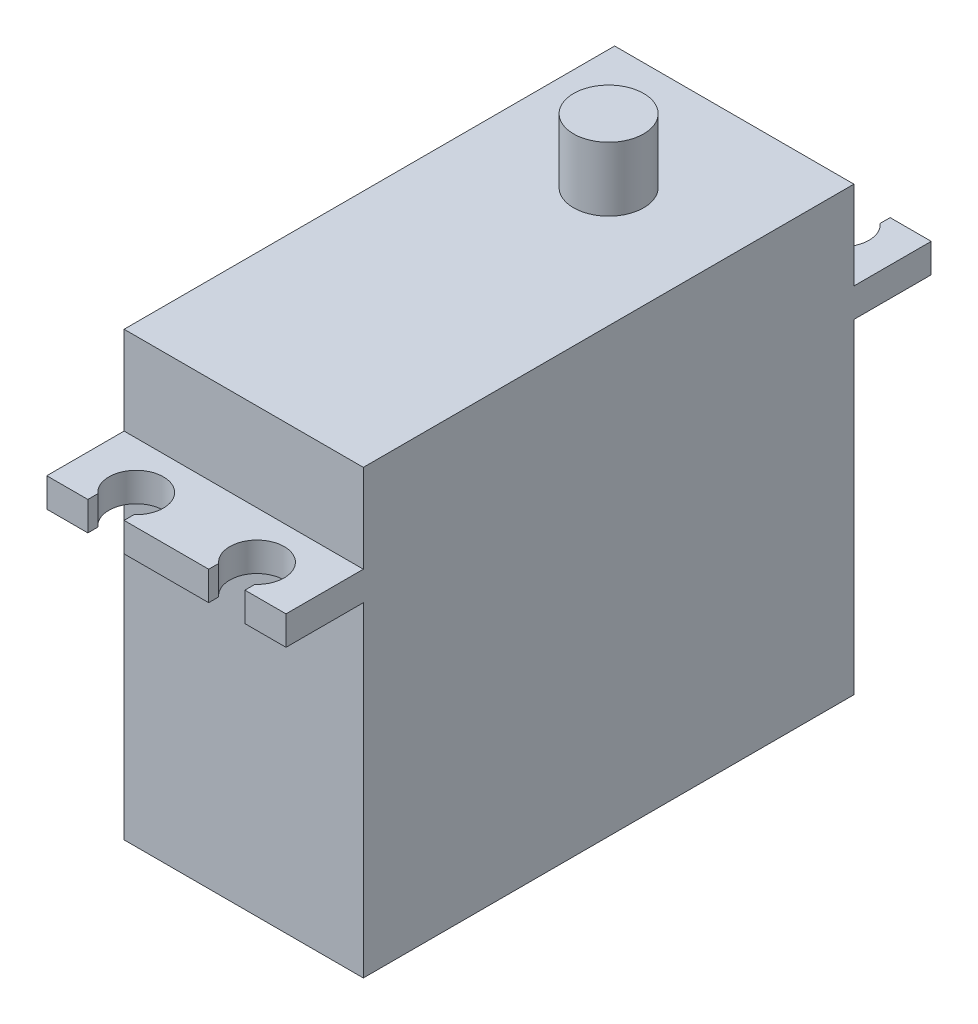
ISO-10303-21;
HEADER;
FILE_DESCRIPTION(('STEP AP214'),'2;1');
FILE_NAME('part.step','',(''),(''),'','','');
FILE_SCHEMA(('AUTOMOTIVE_DESIGN { 1 0 10303 214 1 1 1 1 }'));
ENDSEC;
DATA;
#1=APPLICATION_CONTEXT('core data for automotive mechanical design processes');
#2=APPLICATION_PROTOCOL_DEFINITION('international standard','automotive_design',2000,#1);
#3=PRODUCT_CONTEXT('',#1,'mechanical');
#4=PRODUCT('Part','Part','',(#3));
#5=PRODUCT_RELATED_PRODUCT_CATEGORY('part','',(#4));
#6=PRODUCT_DEFINITION_FORMATION('','',#4);
#7=PRODUCT_DEFINITION_CONTEXT('part definition',#1,'design');
#8=PRODUCT_DEFINITION('design','',#6,#7);
#9=PRODUCT_DEFINITION_SHAPE('','',#8);
#10=(LENGTH_UNIT() NAMED_UNIT(*) SI_UNIT(.MILLI.,.METRE.));
#11=(NAMED_UNIT(*) PLANE_ANGLE_UNIT() SI_UNIT($,.RADIAN.));
#12=(NAMED_UNIT(*) SI_UNIT($,.STERADIAN.) SOLID_ANGLE_UNIT());
#13=UNCERTAINTY_MEASURE_WITH_UNIT(LENGTH_MEASURE(1.E-05),#10,'distance_accuracy_value','');
#14=(GEOMETRIC_REPRESENTATION_CONTEXT(3) GLOBAL_UNCERTAINTY_ASSIGNED_CONTEXT((#13)) GLOBAL_UNIT_ASSIGNED_CONTEXT((#10,
#11,#12)) REPRESENTATION_CONTEXT('',''));
#15=CARTESIAN_POINT('',(0.,0.,0.));
#16=DIRECTION('',(0.,0.,1.));
#17=DIRECTION('',(1.,0.,0.));
#18=AXIS2_PLACEMENT_3D('',#15,#16,#17);
#19=CARTESIAN_POINT('',(19.8,0.,26.7));
#20=DIRECTION('',(0.,0.,-1.));
#21=DIRECTION('',(-1.,0.,0.));
#22=AXIS2_PLACEMENT_3D('',#19,#20,#21);
#23=PLANE('',#22);
#24=DIRECTION('',(0.,1.,0.));
#25=VECTOR('',#24,1.);
#26=CARTESIAN_POINT('',(13.4,-18.3000000000001,26.7));
#27=LINE('',#26,#25);
#28=CARTESIAN_POINT('',(13.4,8.59999999999999,26.7));
#29=VERTEX_POINT('',#28);
#30=CARTESIAN_POINT('',(13.4,10.9999999999999,26.7));
#31=VERTEX_POINT('',#30);
#32=EDGE_CURVE('E61',#29,#31,#27,.T.);
#33=ORIENTED_EDGE('',*,*,#32,.T.);
#34=DIRECTION('',(-1.,0.,0.));
#35=VECTOR('',#34,1.);
#36=CARTESIAN_POINT('',(19.8,11.,26.7));
#37=LINE('',#36,#35);
#38=CARTESIAN_POINT('',(6.4,10.9999999999999,26.7));
#39=VERTEX_POINT('',#38);
#40=EDGE_CURVE('E411',#31,#39,#37,.T.);
#41=ORIENTED_EDGE('',*,*,#40,.T.);
#42=DIRECTION('',(0.,1.,0.));
#43=VECTOR('',#42,1.);
#44=CARTESIAN_POINT('',(6.4,-18.3000000000001,26.7));
#45=LINE('',#44,#43);
#46=CARTESIAN_POINT('',(6.4,8.59999999999999,26.7));
#47=VERTEX_POINT('',#46);
#48=EDGE_CURVE('E249',#47,#39,#45,.T.);
#49=ORIENTED_EDGE('',*,*,#48,.F.);
#50=DIRECTION('',(-1.,0.,0.));
#51=VECTOR('',#50,1.);
#52=CARTESIAN_POINT('',(19.8,8.59999999999999,26.7));
#53=LINE('',#52,#51);
#54=EDGE_CURVE('E406',#29,#47,#53,.T.);
#55=ORIENTED_EDGE('',*,*,#54,.F.);
#56=EDGE_LOOP('',(#33,#41,#49,#55));
#57=FACE_BOUND('',#56,.T.);
#58=ADVANCED_FACE('F38',(#57),#23,.F.);
#59=DIRECTION('',(0.,1.,0.));
#60=VECTOR('',#59,1.);
#61=CARTESIAN_POINT('',(3.4,-18.3000000000001,26.7));
#62=LINE('',#61,#60);
#63=CARTESIAN_POINT('',(3.40000000000001,8.59999999999999,26.7));
#64=VERTEX_POINT('',#63);
#65=CARTESIAN_POINT('',(3.4,10.9999999999999,26.7));
#66=VERTEX_POINT('',#65);
#67=EDGE_CURVE('E53',#64,#66,#62,.T.);
#68=ORIENTED_EDGE('',*,*,#67,.T.);
#69=CARTESIAN_POINT('',(0.,11.,26.7));
#70=VERTEX_POINT('',#69);
#71=EDGE_CURVE('E243',#66,#70,#37,.T.);
#72=ORIENTED_EDGE('',*,*,#71,.T.);
#73=DIRECTION('',(0.,-1.,0.));
#74=VECTOR('',#73,1.);
#75=CARTESIAN_POINT('',(0.,0.,26.7));
#76=LINE('',#75,#74);
#77=CARTESIAN_POINT('',(0.,8.59999999999999,26.7));
#78=VERTEX_POINT('',#77);
#79=EDGE_CURVE('E365',#70,#78,#76,.T.);
#80=ORIENTED_EDGE('',*,*,#79,.T.);
#81=EDGE_CURVE('E402',#64,#78,#53,.T.);
#82=ORIENTED_EDGE('',*,*,#81,.F.);
#83=EDGE_LOOP('',(#68,#72,#80,#82));
#84=FACE_BOUND('',#83,.T.);
#85=ADVANCED_FACE('F456',(#84),#23,.F.);
#86=CARTESIAN_POINT('',(19.8,0.,-26.7));
#87=DIRECTION('',(0.,0.,-1.));
#88=DIRECTION('',(-1.,0.,0.));
#89=AXIS2_PLACEMENT_3D('',#86,#87,#88);
#90=PLANE('',#89);
#91=DIRECTION('',(-1.,0.,0.));
#92=VECTOR('',#91,1.);
#93=CARTESIAN_POINT('',(19.8,8.59999999999999,-26.7));
#94=LINE('',#93,#92);
#95=CARTESIAN_POINT('',(13.4,8.59999999999999,-26.7));
#96=VERTEX_POINT('',#95);
#97=CARTESIAN_POINT('',(6.4,8.59999999999999,-26.7));
#98=VERTEX_POINT('',#97);
#99=EDGE_CURVE('E393',#96,#98,#94,.T.);
#100=ORIENTED_EDGE('',*,*,#99,.T.);
#101=DIRECTION('',(0.,1.,0.));
#102=VECTOR('',#101,1.);
#103=CARTESIAN_POINT('',(6.4,-18.3,-26.7));
#104=LINE('',#103,#102);
#105=CARTESIAN_POINT('',(6.4,11.,-26.7));
#106=VERTEX_POINT('',#105);
#107=EDGE_CURVE('E267',#98,#106,#104,.T.);
#108=ORIENTED_EDGE('',*,*,#107,.T.);
#109=DIRECTION('',(-1.,0.,0.));
#110=VECTOR('',#109,1.);
#111=CARTESIAN_POINT('',(19.8,11.,-26.7));
#112=LINE('',#111,#110);
#113=CARTESIAN_POINT('',(13.4,11.,-26.7));
#114=VERTEX_POINT('',#113);
#115=EDGE_CURVE('E388',#114,#106,#112,.T.);
#116=ORIENTED_EDGE('',*,*,#115,.F.);
#117=DIRECTION('',(0.,1.,0.));
#118=VECTOR('',#117,1.);
#119=CARTESIAN_POINT('',(13.4,-18.3,-26.7));
#120=LINE('',#119,#118);
#121=EDGE_CURVE('E297',#96,#114,#120,.T.);
#122=ORIENTED_EDGE('',*,*,#121,.F.);
#123=EDGE_LOOP('',(#100,#108,#116,#122));
#124=FACE_BOUND('',#123,.T.);
#125=ADVANCED_FACE('F527',(#124),#90,.T.);
#126=CARTESIAN_POINT('',(19.8,8.59999999999999,-26.7));
#127=VERTEX_POINT('',#126);
#128=CARTESIAN_POINT('',(16.4,8.59999999999999,-26.7));
#129=VERTEX_POINT('',#128);
#130=EDGE_CURVE('E389',#127,#129,#94,.T.);
#131=ORIENTED_EDGE('',*,*,#130,.T.);
#132=DIRECTION('',(0.,1.,0.));
#133=VECTOR('',#132,1.);
#134=CARTESIAN_POINT('',(16.4,-18.3,-26.7));
#135=LINE('',#134,#133);
#136=CARTESIAN_POINT('',(16.4,11.,-26.7));
#137=VERTEX_POINT('',#136);
#138=EDGE_CURVE('E299',#129,#137,#135,.T.);
#139=ORIENTED_EDGE('',*,*,#138,.T.);
#140=CARTESIAN_POINT('',(19.8,11.,-26.7));
#141=VERTEX_POINT('',#140);
#142=EDGE_CURVE('E384',#141,#137,#112,.T.);
#143=ORIENTED_EDGE('',*,*,#142,.F.);
#144=DIRECTION('',(0.,-1.,0.));
#145=VECTOR('',#144,1.);
#146=CARTESIAN_POINT('',(19.8,0.,-26.7));
#147=LINE('',#146,#145);
#148=EDGE_CURVE('E348',#141,#127,#147,.T.);
#149=ORIENTED_EDGE('',*,*,#148,.T.);
#150=EDGE_LOOP('',(#131,#139,#143,#149));
#151=FACE_BOUND('',#150,.T.);
#152=ADVANCED_FACE('F511',(#151),#90,.T.);
#153=CARTESIAN_POINT('',(19.8,0.,0.));
#154=DIRECTION('',(1.,0.,0.));
#155=DIRECTION('',(0.,0.,-1.));
#156=AXIS2_PLACEMENT_3D('',#153,#154,#155);
#157=PLANE('',#156);
#158=DIRECTION('',(0.,0.,-1.));
#159=VECTOR('',#158,1.);
#160=CARTESIAN_POINT('',(19.8,18.3,0.));
#161=LINE('',#160,#159);
#162=CARTESIAN_POINT('',(19.8,18.3,20.3));
#163=VERTEX_POINT('',#162);
#164=CARTESIAN_POINT('',(19.8,18.3,-20.3));
#165=VERTEX_POINT('',#164);
#166=EDGE_CURVE('E329',#163,#165,#161,.T.);
#167=ORIENTED_EDGE('',*,*,#166,.F.);
#168=DIRECTION('',(0.,-1.,0.));
#169=VECTOR('',#168,1.);
#170=CARTESIAN_POINT('',(19.8,0.,20.3));
#171=LINE('',#170,#169);
#172=CARTESIAN_POINT('',(19.8,11.,20.3));
#173=VERTEX_POINT('',#172);
#174=EDGE_CURVE('E334',#163,#173,#171,.T.);
#175=ORIENTED_EDGE('',*,*,#174,.T.);
#176=DIRECTION('',(0.,0.,1.));
#177=VECTOR('',#176,1.);
#178=CARTESIAN_POINT('',(19.8,11.,0.));
#179=LINE('',#178,#177);
#180=CARTESIAN_POINT('',(19.8,11.,26.7));
#181=VERTEX_POINT('',#180);
#182=EDGE_CURVE('E336',#173,#181,#179,.T.);
#183=ORIENTED_EDGE('',*,*,#182,.T.);
#184=DIRECTION('',(0.,-1.,0.));
#185=VECTOR('',#184,1.);
#186=CARTESIAN_POINT('',(19.8,0.,26.7));
#187=LINE('',#186,#185);
#188=CARTESIAN_POINT('',(19.8,8.59999999999999,26.7));
#189=VERTEX_POINT('',#188);
#190=EDGE_CURVE('E339',#181,#189,#187,.T.);
#191=ORIENTED_EDGE('',*,*,#190,.T.);
#192=DIRECTION('',(0.,0.,1.));
#193=VECTOR('',#192,1.);
#194=CARTESIAN_POINT('',(19.8,8.59999999999999,0.));
#195=LINE('',#194,#193);
#196=CARTESIAN_POINT('',(19.8,8.59999999999999,20.3));
#197=VERTEX_POINT('',#196);
#198=EDGE_CURVE('E341',#197,#189,#195,.T.);
#199=ORIENTED_EDGE('',*,*,#198,.F.);
#200=CARTESIAN_POINT('',(19.8,-18.3,20.3));
#201=VERTEX_POINT('',#200);
#202=EDGE_CURVE('E337',#197,#201,#171,.T.);
#203=ORIENTED_EDGE('',*,*,#202,.T.);
#204=DIRECTION('',(0.,0.,-1.));
#205=VECTOR('',#204,1.);
#206=CARTESIAN_POINT('',(19.8,-18.3,0.));
#207=LINE('',#206,#205);
#208=CARTESIAN_POINT('',(19.8,-18.3,-20.3));
#209=VERTEX_POINT('',#208);
#210=EDGE_CURVE('E344',#201,#209,#207,.T.);
#211=ORIENTED_EDGE('',*,*,#210,.T.);
#212=DIRECTION('',(0.,-1.,0.));
#213=VECTOR('',#212,1.);
#214=CARTESIAN_POINT('',(19.8,0.,-20.3));
#215=LINE('',#214,#213);
#216=CARTESIAN_POINT('',(19.8,8.6,-20.3));
#217=VERTEX_POINT('',#216);
#218=EDGE_CURVE('E331',#217,#209,#215,.T.);
#219=ORIENTED_EDGE('',*,*,#218,.F.);
#220=DIRECTION('',(0.,0.,-1.));
#221=VECTOR('',#220,1.);
#222=CARTESIAN_POINT('',(19.8,8.60000000000001,0.));
#223=LINE('',#222,#221);
#224=EDGE_CURVE('E346',#217,#127,#223,.T.);
#225=ORIENTED_EDGE('',*,*,#224,.T.);
#226=ORIENTED_EDGE('',*,*,#148,.F.);
#227=DIRECTION('',(0.,0.,-1.));
#228=VECTOR('',#227,1.);
#229=CARTESIAN_POINT('',(19.8,11.,0.));
#230=LINE('',#229,#228);
#231=CARTESIAN_POINT('',(19.8,11.,-20.3));
#232=VERTEX_POINT('',#231);
#233=EDGE_CURVE('E351',#232,#141,#230,.T.);
#234=ORIENTED_EDGE('',*,*,#233,.F.);
#235=EDGE_CURVE('E326',#165,#232,#215,.T.);
#236=ORIENTED_EDGE('',*,*,#235,.F.);
#237=EDGE_LOOP('',(#167,#175,#183,#191,#199,#203,#211,#219,#225,#226,#234,#236));
#238=FACE_BOUND('',#237,.T.);
#239=ADVANCED_FACE('F474',(#238),#157,.T.);
#240=CARTESIAN_POINT('',(19.8,23.6,0.));
#241=DIRECTION('',(0.,1.,0.));
#242=DIRECTION('',(0.,0.,1.));
#243=AXIS2_PLACEMENT_3D('',#240,#241,#242);
#244=PLANE('',#243);
#245=CARTESIAN_POINT('',(9.9,23.6,-9.9));
#246=DIRECTION('',(0.,1.,0.));
#247=DIRECTION('',(0.,0.,1.));
#248=AXIS2_PLACEMENT_3D('',#245,#246,#247);
#249=CIRCLE('',#248,2.9);
#250=CARTESIAN_POINT('',(9.9,23.6,-7.));
#251=VERTEX_POINT('',#250);
#252=EDGE_CURVE('E322',#251,#251,#249,.T.);
#253=ORIENTED_EDGE('',*,*,#252,.T.);
#254=EDGE_LOOP('',(#253));
#255=FACE_BOUND('',#254,.T.);
#256=ADVANCED_FACE('F40',(#255),#244,.T.);
#257=CARTESIAN_POINT('',(0.,0.,0.));
#258=DIRECTION('',(1.,0.,0.));
#259=DIRECTION('',(0.,0.,-1.));
#260=AXIS2_PLACEMENT_3D('',#257,#258,#259);
#261=PLANE('',#260);
#262=DIRECTION('',(0.,0.,-1.));
#263=VECTOR('',#262,1.);
#264=CARTESIAN_POINT('',(0.,18.3,0.));
#265=LINE('',#264,#263);
#266=CARTESIAN_POINT('',(0.,18.3,20.3));
#267=VERTEX_POINT('',#266);
#268=CARTESIAN_POINT('',(0.,18.3,-20.3));
#269=VERTEX_POINT('',#268);
#270=EDGE_CURVE('E357',#267,#269,#265,.T.);
#271=ORIENTED_EDGE('',*,*,#270,.T.);
#272=DIRECTION('',(0.,-1.,0.));
#273=VECTOR('',#272,1.);
#274=CARTESIAN_POINT('',(0.,0.,-20.3));
#275=LINE('',#274,#273);
#276=CARTESIAN_POINT('',(0.,11.,-20.3));
#277=VERTEX_POINT('',#276);
#278=EDGE_CURVE('E325',#269,#277,#275,.T.);
#279=ORIENTED_EDGE('',*,*,#278,.T.);
#280=DIRECTION('',(0.,0.,-1.));
#281=VECTOR('',#280,1.);
#282=CARTESIAN_POINT('',(0.,11.,0.));
#283=LINE('',#282,#281);
#284=CARTESIAN_POINT('',(0.,11.,-26.7));
#285=VERTEX_POINT('',#284);
#286=EDGE_CURVE('E330',#277,#285,#283,.T.);
#287=ORIENTED_EDGE('',*,*,#286,.T.);
#288=DIRECTION('',(0.,-1.,0.));
#289=VECTOR('',#288,1.);
#290=CARTESIAN_POINT('',(0.,0.,-26.7));
#291=LINE('',#290,#289);
#292=CARTESIAN_POINT('',(0.,8.59999999999999,-26.7));
#293=VERTEX_POINT('',#292);
#294=EDGE_CURVE('E377',#285,#293,#291,.T.);
#295=ORIENTED_EDGE('',*,*,#294,.T.);
#296=DIRECTION('',(0.,0.,-1.));
#297=VECTOR('',#296,1.);
#298=CARTESIAN_POINT('',(0.,8.60000000000001,0.));
#299=LINE('',#298,#297);
#300=CARTESIAN_POINT('',(0.,8.6,-20.3));
#301=VERTEX_POINT('',#300);
#302=EDGE_CURVE('E374',#301,#293,#299,.T.);
#303=ORIENTED_EDGE('',*,*,#302,.F.);
#304=CARTESIAN_POINT('',(0.,-18.3,-20.3));
#305=VERTEX_POINT('',#304);
#306=EDGE_CURVE('E358',#301,#305,#275,.T.);
#307=ORIENTED_EDGE('',*,*,#306,.T.);
#308=DIRECTION('',(0.,0.,-1.));
#309=VECTOR('',#308,1.);
#310=CARTESIAN_POINT('',(0.,-18.3,0.));
#311=LINE('',#310,#309);
#312=CARTESIAN_POINT('',(0.,-18.3,20.3));
#313=VERTEX_POINT('',#312);
#314=EDGE_CURVE('E371',#313,#305,#311,.T.);
#315=ORIENTED_EDGE('',*,*,#314,.F.);
#316=DIRECTION('',(0.,-1.,0.));
#317=VECTOR('',#316,1.);
#318=CARTESIAN_POINT('',(0.,0.,20.3));
#319=LINE('',#318,#317);
#320=CARTESIAN_POINT('',(0.,8.59999999999999,20.3));
#321=VERTEX_POINT('',#320);
#322=EDGE_CURVE('E363',#321,#313,#319,.T.);
#323=ORIENTED_EDGE('',*,*,#322,.F.);
#324=DIRECTION('',(0.,0.,1.));
#325=VECTOR('',#324,1.);
#326=CARTESIAN_POINT('',(0.,8.59999999999999,0.));
#327=LINE('',#326,#325);
#328=EDGE_CURVE('E368',#321,#78,#327,.T.);
#329=ORIENTED_EDGE('',*,*,#328,.T.);
#330=ORIENTED_EDGE('',*,*,#79,.F.);
#331=DIRECTION('',(0.,0.,1.));
#332=VECTOR('',#331,1.);
#333=CARTESIAN_POINT('',(0.,11.,0.));
#334=LINE('',#333,#332);
#335=CARTESIAN_POINT('',(0.,11.,20.3));
#336=VERTEX_POINT('',#335);
#337=EDGE_CURVE('E362',#336,#70,#334,.T.);
#338=ORIENTED_EDGE('',*,*,#337,.F.);
#339=EDGE_CURVE('E360',#267,#336,#319,.T.);
#340=ORIENTED_EDGE('',*,*,#339,.F.);
#341=EDGE_LOOP('',(#271,#279,#287,#295,#303,#307,#315,#323,#329,#330,#338,#340));
#342=FACE_BOUND('',#341,.T.);
#343=ADVANCED_FACE('F460',(#342),#261,.F.);
#344=CARTESIAN_POINT('',(19.8,0.,-20.3));
#345=DIRECTION('',(0.,0.,-1.));
#346=DIRECTION('',(0.,1.,0.));
#347=AXIS2_PLACEMENT_3D('',#344,#345,#346);
#348=PLANE('',#347);
#349=ORIENTED_EDGE('',*,*,#278,.F.);
#350=DIRECTION('',(-1.,0.,0.));
#351=VECTOR('',#350,1.);
#352=CARTESIAN_POINT('',(19.8,18.3,-20.3));
#353=LINE('',#352,#351);
#354=EDGE_CURVE('E416',#165,#269,#353,.T.);
#355=ORIENTED_EDGE('',*,*,#354,.F.);
#356=ORIENTED_EDGE('',*,*,#235,.T.);
#357=DIRECTION('',(-1.,0.,0.));
#358=VECTOR('',#357,1.);
#359=CARTESIAN_POINT('',(19.8,11.,-20.3));
#360=LINE('',#359,#358);
#361=EDGE_CURVE('E354',#232,#277,#360,.T.);
#362=ORIENTED_EDGE('',*,*,#361,.T.);
#363=EDGE_LOOP('',(#349,#355,#356,#362));
#364=FACE_BOUND('',#363,.T.);
#365=ADVANCED_FACE('F486',(#364),#348,.T.);
#366=CARTESIAN_POINT('',(19.8,18.3,0.));
#367=DIRECTION('',(0.,1.,0.));
#368=DIRECTION('',(0.,0.,1.));
#369=AXIS2_PLACEMENT_3D('',#366,#367,#368);
#370=PLANE('',#369);
#371=CARTESIAN_POINT('',(9.9,18.3,-9.9));
#372=DIRECTION('',(0.,1.,0.));
#373=DIRECTION('',(0.,0.,1.));
#374=AXIS2_PLACEMENT_3D('',#371,#372,#373);
#375=CIRCLE('',#374,2.9);
#376=CARTESIAN_POINT('',(9.9,18.3,-7.));
#377=VERTEX_POINT('',#376);
#378=EDGE_CURVE('E319',#377,#377,#375,.T.);
#379=ORIENTED_EDGE('',*,*,#378,.F.);
#380=EDGE_LOOP('',(#379));
#381=FACE_BOUND('',#380,.T.);
#382=ORIENTED_EDGE('',*,*,#270,.F.);
#383=DIRECTION('',(-1.,0.,0.));
#384=VECTOR('',#383,1.);
#385=CARTESIAN_POINT('',(19.8,18.3,20.3));
#386=LINE('',#385,#384);
#387=EDGE_CURVE('E414',#163,#267,#386,.T.);
#388=ORIENTED_EDGE('',*,*,#387,.F.);
#389=ORIENTED_EDGE('',*,*,#166,.T.);
#390=ORIENTED_EDGE('',*,*,#354,.T.);
#391=EDGE_LOOP('',(#382,#388,#389,#390));
#392=FACE_BOUND('',#391,.T.);
#393=ADVANCED_FACE('F482',(#381,#392),#370,.T.);
#394=CARTESIAN_POINT('',(19.8,0.,20.3));
#395=DIRECTION('',(0.,0.,-1.));
#396=DIRECTION('',(0.,1.,0.));
#397=AXIS2_PLACEMENT_3D('',#394,#395,#396);
#398=PLANE('',#397);
#399=ORIENTED_EDGE('',*,*,#339,.T.);
#400=DIRECTION('',(-1.,0.,0.));
#401=VECTOR('',#400,1.);
#402=CARTESIAN_POINT('',(19.8,11.,20.3));
#403=LINE('',#402,#401);
#404=EDGE_CURVE('E410',#173,#336,#403,.T.);
#405=ORIENTED_EDGE('',*,*,#404,.F.);
#406=ORIENTED_EDGE('',*,*,#174,.F.);
#407=ORIENTED_EDGE('',*,*,#387,.T.);
#408=EDGE_LOOP('',(#399,#405,#406,#407));
#409=FACE_BOUND('',#408,.T.);
#410=ADVANCED_FACE('F558',(#409),#398,.F.);
#411=CARTESIAN_POINT('',(19.8,11.,0.));
#412=DIRECTION('',(0.,-1.,0.));
#413=DIRECTION('',(0.,0.,-1.));
#414=AXIS2_PLACEMENT_3D('',#411,#412,#413);
#415=PLANE('',#414);
#416=CARTESIAN_POINT('',(14.9,11.,24.2));
#417=DIRECTION('',(0.,1.,0.));
#418=DIRECTION('',(0.,0.,1.));
#419=AXIS2_PLACEMENT_3D('',#416,#417,#418);
#420=CIRCLE('',#419,2.25);
#421=CARTESIAN_POINT('',(16.4,10.9999999999999,25.8770509831248));
#422=VERTEX_POINT('',#421);
#423=CARTESIAN_POINT('',(13.4,10.9999999999999,25.8770509831249));
#424=VERTEX_POINT('',#423);
#425=EDGE_CURVE('E248',#422,#424,#420,.T.);
#426=ORIENTED_EDGE('',*,*,#425,.F.);
#427=DIRECTION('',(0.,0.,-1.));
#428=VECTOR('',#427,1.);
#429=CARTESIAN_POINT('',(16.4,11.,0.));
#430=LINE('',#429,#428);
#431=CARTESIAN_POINT('',(16.4,10.9999999999999,26.7));
#432=VERTEX_POINT('',#431);
#433=EDGE_CURVE('E277',#432,#422,#430,.T.);
#434=ORIENTED_EDGE('',*,*,#433,.F.);
#435=EDGE_CURVE('E407',#181,#432,#37,.T.);
#436=ORIENTED_EDGE('',*,*,#435,.F.);
#437=ORIENTED_EDGE('',*,*,#182,.F.);
#438=ORIENTED_EDGE('',*,*,#404,.T.);
#439=ORIENTED_EDGE('',*,*,#337,.T.);
#440=ORIENTED_EDGE('',*,*,#71,.F.);
#441=DIRECTION('',(0.,0.,-1.));
#442=VECTOR('',#441,1.);
#443=CARTESIAN_POINT('',(3.39999999999999,11.,0.));
#444=LINE('',#443,#442);
#445=CARTESIAN_POINT('',(3.4,10.9999999999999,25.8770509831248));
#446=VERTEX_POINT('',#445);
#447=EDGE_CURVE('E224',#66,#446,#444,.T.);
#448=ORIENTED_EDGE('',*,*,#447,.T.);
#449=CARTESIAN_POINT('',(4.9,11.,24.2));
#450=DIRECTION('',(0.,1.,0.));
#451=DIRECTION('',(0.,0.,1.));
#452=AXIS2_PLACEMENT_3D('',#449,#450,#451);
#453=CIRCLE('',#452,2.25);
#454=CARTESIAN_POINT('',(6.4,10.9999999999999,25.8770509831248));
#455=VERTEX_POINT('',#454);
#456=EDGE_CURVE('E231',#455,#446,#453,.T.);
#457=ORIENTED_EDGE('',*,*,#456,.F.);
#458=DIRECTION('',(0.,0.,-1.));
#459=VECTOR('',#458,1.);
#460=CARTESIAN_POINT('',(6.4,11.,0.));
#461=LINE('',#460,#459);
#462=EDGE_CURVE('E228',#39,#455,#461,.T.);
#463=ORIENTED_EDGE('',*,*,#462,.F.);
#464=ORIENTED_EDGE('',*,*,#40,.F.);
#465=DIRECTION('',(0.,0.,-1.));
#466=VECTOR('',#465,1.);
#467=CARTESIAN_POINT('',(13.4,11.,0.));
#468=LINE('',#467,#466);
#469=EDGE_CURVE('E274',#31,#424,#468,.T.);
#470=ORIENTED_EDGE('',*,*,#469,.T.);
#471=EDGE_LOOP('',(#426,#434,#436,#437,#438,#439,#440,#448,#457,#463,#464,#470));
#472=FACE_BOUND('',#471,.T.);
#473=ADVANCED_FACE('F241',(#472),#415,.F.);
#474=ORIENTED_EDGE('',*,*,#435,.T.);
#475=DIRECTION('',(0.,1.,0.));
#476=VECTOR('',#475,1.);
#477=CARTESIAN_POINT('',(16.4,-18.3000000000001,26.7));
#478=LINE('',#477,#476);
#479=CARTESIAN_POINT('',(16.4,8.59999999999999,26.7));
#480=VERTEX_POINT('',#479);
#481=EDGE_CURVE('E282',#480,#432,#478,.T.);
#482=ORIENTED_EDGE('',*,*,#481,.F.);
#483=EDGE_CURVE('E403',#189,#480,#53,.T.);
#484=ORIENTED_EDGE('',*,*,#483,.F.);
#485=ORIENTED_EDGE('',*,*,#190,.F.);
#486=EDGE_LOOP('',(#474,#482,#484,#485));
#487=FACE_BOUND('',#486,.T.);
#488=ADVANCED_FACE('F441',(#487),#23,.F.);
#489=CARTESIAN_POINT('',(19.8,8.59999999999999,0.));
#490=DIRECTION('',(0.,-1.,0.));
#491=DIRECTION('',(0.,0.,-1.));
#492=AXIS2_PLACEMENT_3D('',#489,#490,#491);
#493=PLANE('',#492);
#494=DIRECTION('',(0.,0.,1.));
#495=VECTOR('',#494,1.);
#496=CARTESIAN_POINT('',(16.4,8.59999999999999,0.));
#497=LINE('',#496,#495);
#498=CARTESIAN_POINT('',(16.4,8.59999999999999,25.8770509831248));
#499=VERTEX_POINT('',#498);
#500=EDGE_CURVE('E11',#499,#480,#497,.T.);
#501=ORIENTED_EDGE('',*,*,#500,.F.);
#502=CARTESIAN_POINT('',(14.9,8.59999999999999,24.2));
#503=DIRECTION('',(0.,-1.,0.));
#504=DIRECTION('',(0.,0.,-1.));
#505=AXIS2_PLACEMENT_3D('',#502,#503,#504);
#506=CIRCLE('',#505,2.25);
#507=CARTESIAN_POINT('',(13.4,8.59999999999999,25.8770509831248));
#508=VERTEX_POINT('',#507);
#509=EDGE_CURVE('E46',#508,#499,#506,.T.);
#510=ORIENTED_EDGE('',*,*,#509,.F.);
#511=DIRECTION('',(0.,0.,1.));
#512=VECTOR('',#511,1.);
#513=CARTESIAN_POINT('',(13.4,8.59999999999999,0.));
#514=LINE('',#513,#512);
#515=EDGE_CURVE('E424',#508,#29,#514,.T.);
#516=ORIENTED_EDGE('',*,*,#515,.T.);
#517=ORIENTED_EDGE('',*,*,#54,.T.);
#518=DIRECTION('',(0.,0.,1.));
#519=VECTOR('',#518,1.);
#520=CARTESIAN_POINT('',(6.4,8.59999999999999,0.));
#521=LINE('',#520,#519);
#522=CARTESIAN_POINT('',(6.4,8.59999999999999,25.8770509831248));
#523=VERTEX_POINT('',#522);
#524=EDGE_CURVE('E422',#523,#47,#521,.T.);
#525=ORIENTED_EDGE('',*,*,#524,.F.);
#526=CARTESIAN_POINT('',(4.9,8.59999999999999,24.2));
#527=DIRECTION('',(0.,-1.,0.));
#528=DIRECTION('',(0.,0.,-1.));
#529=AXIS2_PLACEMENT_3D('',#526,#527,#528);
#530=CIRCLE('',#529,2.25);
#531=CARTESIAN_POINT('',(3.4,8.59999999999999,25.8770509831248));
#532=VERTEX_POINT('',#531);
#533=EDGE_CURVE('E420',#532,#523,#530,.T.);
#534=ORIENTED_EDGE('',*,*,#533,.F.);
#535=DIRECTION('',(0.,0.,1.));
#536=VECTOR('',#535,1.);
#537=CARTESIAN_POINT('',(3.39999999999999,8.59999999999999,0.));
#538=LINE('',#537,#536);
#539=EDGE_CURVE('E225',#532,#64,#538,.T.);
#540=ORIENTED_EDGE('',*,*,#539,.T.);
#541=ORIENTED_EDGE('',*,*,#81,.T.);
#542=ORIENTED_EDGE('',*,*,#328,.F.);
#543=DIRECTION('',(-1.,0.,0.));
#544=VECTOR('',#543,1.);
#545=CARTESIAN_POINT('',(19.8,8.59999999999999,20.3));
#546=LINE('',#545,#544);
#547=EDGE_CURVE('E400',#197,#321,#546,.T.);
#548=ORIENTED_EDGE('',*,*,#547,.F.);
#549=ORIENTED_EDGE('',*,*,#198,.T.);
#550=ORIENTED_EDGE('',*,*,#483,.T.);
#551=EDGE_LOOP('',(#501,#510,#516,#517,#525,#534,#540,#541,#542,#548,#549,#550));
#552=FACE_BOUND('',#551,.T.);
#553=ADVANCED_FACE('F436',(#552),#493,.T.);
#554=ORIENTED_EDGE('',*,*,#322,.T.);
#555=DIRECTION('',(-1.,0.,0.));
#556=VECTOR('',#555,1.);
#557=CARTESIAN_POINT('',(19.8,-18.3,20.3));
#558=LINE('',#557,#556);
#559=EDGE_CURVE('E397',#201,#313,#558,.T.);
#560=ORIENTED_EDGE('',*,*,#559,.F.);
#561=ORIENTED_EDGE('',*,*,#202,.F.);
#562=ORIENTED_EDGE('',*,*,#547,.T.);
#563=EDGE_LOOP('',(#554,#560,#561,#562));
#564=FACE_BOUND('',#563,.T.);
#565=ADVANCED_FACE('F465',(#564),#398,.F.);
#566=CARTESIAN_POINT('',(19.8,-18.3,0.));
#567=DIRECTION('',(0.,1.,0.));
#568=DIRECTION('',(0.,0.,1.));
#569=AXIS2_PLACEMENT_3D('',#566,#567,#568);
#570=PLANE('',#569);
#571=ORIENTED_EDGE('',*,*,#314,.T.);
#572=DIRECTION('',(-1.,0.,0.));
#573=VECTOR('',#572,1.);
#574=CARTESIAN_POINT('',(19.8,-18.3,-20.3));
#575=LINE('',#574,#573);
#576=EDGE_CURVE('E395',#209,#305,#575,.T.);
#577=ORIENTED_EDGE('',*,*,#576,.F.);
#578=ORIENTED_EDGE('',*,*,#210,.F.);
#579=ORIENTED_EDGE('',*,*,#559,.T.);
#580=EDGE_LOOP('',(#571,#577,#578,#579));
#581=FACE_BOUND('',#580,.T.);
#582=ADVANCED_FACE('F469',(#581),#570,.F.);
#583=ORIENTED_EDGE('',*,*,#306,.F.);
#584=DIRECTION('',(-1.,0.,0.));
#585=VECTOR('',#584,1.);
#586=CARTESIAN_POINT('',(19.8,8.6,-20.3));
#587=LINE('',#586,#585);
#588=EDGE_CURVE('E392',#217,#301,#587,.T.);
#589=ORIENTED_EDGE('',*,*,#588,.F.);
#590=ORIENTED_EDGE('',*,*,#218,.T.);
#591=ORIENTED_EDGE('',*,*,#576,.T.);
#592=EDGE_LOOP('',(#583,#589,#590,#591));
#593=FACE_BOUND('',#592,.T.);
#594=ADVANCED_FACE('F502',(#593),#348,.T.);
#595=CARTESIAN_POINT('',(19.8,8.60000000000001,0.));
#596=DIRECTION('',(0.,1.,0.));
#597=DIRECTION('',(0.,0.,1.));
#598=AXIS2_PLACEMENT_3D('',#595,#596,#597);
#599=PLANE('',#598);
#600=CARTESIAN_POINT('',(3.4,8.59999999999999,-26.7));
#601=VERTEX_POINT('',#600);
#602=EDGE_CURVE('E387',#601,#293,#94,.T.);
#603=ORIENTED_EDGE('',*,*,#602,.F.);
#604=DIRECTION('',(0.,0.,1.));
#605=VECTOR('',#604,1.);
#606=CARTESIAN_POINT('',(3.4,8.60000000000001,0.));
#607=LINE('',#606,#605);
#608=CARTESIAN_POINT('',(3.4,8.59999999999999,-25.8770509831248));
#609=VERTEX_POINT('',#608);
#610=EDGE_CURVE('E313',#601,#609,#607,.T.);
#611=ORIENTED_EDGE('',*,*,#610,.T.);
#612=CARTESIAN_POINT('',(4.9,8.59999999999999,-24.2));
#613=DIRECTION('',(0.,1.,0.));
#614=DIRECTION('',(0.,0.,1.));
#615=AXIS2_PLACEMENT_3D('',#612,#613,#614);
#616=CIRCLE('',#615,2.25);
#617=CARTESIAN_POINT('',(6.4,8.59999999999999,-25.8770509831248));
#618=VERTEX_POINT('',#617);
#619=EDGE_CURVE('E316',#609,#618,#616,.T.);
#620=ORIENTED_EDGE('',*,*,#619,.T.);
#621=DIRECTION('',(0.,0.,1.));
#622=VECTOR('',#621,1.);
#623=CARTESIAN_POINT('',(6.4,8.60000000000001,0.));
#624=LINE('',#623,#622);
#625=EDGE_CURVE('E311',#98,#618,#624,.T.);
#626=ORIENTED_EDGE('',*,*,#625,.F.);
#627=ORIENTED_EDGE('',*,*,#99,.F.);
#628=DIRECTION('',(0.,0.,1.));
#629=VECTOR('',#628,1.);
#630=CARTESIAN_POINT('',(13.4,8.60000000000001,0.));
#631=LINE('',#630,#629);
#632=CARTESIAN_POINT('',(13.4,8.59999999999999,-25.8770509831248));
#633=VERTEX_POINT('',#632);
#634=EDGE_CURVE('E305',#96,#633,#631,.T.);
#635=ORIENTED_EDGE('',*,*,#634,.T.);
#636=CARTESIAN_POINT('',(14.9,8.59999999999999,-24.2));
#637=DIRECTION('',(0.,1.,0.));
#638=DIRECTION('',(0.,0.,1.));
#639=AXIS2_PLACEMENT_3D('',#636,#637,#638);
#640=CIRCLE('',#639,2.25);
#641=CARTESIAN_POINT('',(16.4,8.59999999999999,-25.8770509831248));
#642=VERTEX_POINT('',#641);
#643=EDGE_CURVE('E308',#633,#642,#640,.T.);
#644=ORIENTED_EDGE('',*,*,#643,.T.);
#645=DIRECTION('',(0.,0.,1.));
#646=VECTOR('',#645,1.);
#647=CARTESIAN_POINT('',(16.4,8.60000000000001,0.));
#648=LINE('',#647,#646);
#649=EDGE_CURVE('E296',#129,#642,#648,.T.);
#650=ORIENTED_EDGE('',*,*,#649,.F.);
#651=ORIENTED_EDGE('',*,*,#130,.F.);
#652=ORIENTED_EDGE('',*,*,#224,.F.);
#653=ORIENTED_EDGE('',*,*,#588,.T.);
#654=ORIENTED_EDGE('',*,*,#302,.T.);
#655=EDGE_LOOP('',(#603,#611,#620,#626,#627,#635,#644,#650,#651,#652,#653,#654));
#656=FACE_BOUND('',#655,.T.);
#657=ADVANCED_FACE('F505',(#656),#599,.F.);
#658=DIRECTION('',(0.,1.,0.));
#659=VECTOR('',#658,1.);
#660=CARTESIAN_POINT('',(3.4,-18.3,-26.7));
#661=LINE('',#660,#659);
#662=CARTESIAN_POINT('',(3.4,11.,-26.7));
#663=VERTEX_POINT('',#662);
#664=EDGE_CURVE('E265',#601,#663,#661,.T.);
#665=ORIENTED_EDGE('',*,*,#664,.F.);
#666=ORIENTED_EDGE('',*,*,#602,.T.);
#667=ORIENTED_EDGE('',*,*,#294,.F.);
#668=EDGE_CURVE('E383',#663,#285,#112,.T.);
#669=ORIENTED_EDGE('',*,*,#668,.F.);
#670=EDGE_LOOP('',(#665,#666,#667,#669));
#671=FACE_BOUND('',#670,.T.);
#672=ADVANCED_FACE('F496',(#671),#90,.T.);
#673=CARTESIAN_POINT('',(19.8,11.,0.));
#674=DIRECTION('',(0.,1.,0.));
#675=DIRECTION('',(0.,0.,1.));
#676=AXIS2_PLACEMENT_3D('',#673,#674,#675);
#677=PLANE('',#676);
#678=DIRECTION('',(0.,0.,1.));
#679=VECTOR('',#678,1.);
#680=CARTESIAN_POINT('',(3.4,11.,0.));
#681=LINE('',#680,#679);
#682=CARTESIAN_POINT('',(3.4,11.,-25.8770509831248));
#683=VERTEX_POINT('',#682);
#684=EDGE_CURVE('E258',#663,#683,#681,.T.);
#685=ORIENTED_EDGE('',*,*,#684,.F.);
#686=ORIENTED_EDGE('',*,*,#668,.T.);
#687=ORIENTED_EDGE('',*,*,#286,.F.);
#688=ORIENTED_EDGE('',*,*,#361,.F.);
#689=ORIENTED_EDGE('',*,*,#233,.T.);
#690=ORIENTED_EDGE('',*,*,#142,.T.);
#691=DIRECTION('',(0.,0.,1.));
#692=VECTOR('',#691,1.);
#693=CARTESIAN_POINT('',(16.4,11.,0.));
#694=LINE('',#693,#692);
#695=CARTESIAN_POINT('',(16.4,11.,-25.8770509831248));
#696=VERTEX_POINT('',#695);
#697=EDGE_CURVE('E287',#137,#696,#694,.T.);
#698=ORIENTED_EDGE('',*,*,#697,.T.);
#699=CARTESIAN_POINT('',(14.9,11.,-24.2));
#700=DIRECTION('',(0.,1.,0.));
#701=DIRECTION('',(0.,0.,1.));
#702=AXIS2_PLACEMENT_3D('',#699,#700,#701);
#703=CIRCLE('',#702,2.25);
#704=CARTESIAN_POINT('',(13.4,11.,-25.8770509831248));
#705=VERTEX_POINT('',#704);
#706=EDGE_CURVE('E264',#705,#696,#703,.T.);
#707=ORIENTED_EDGE('',*,*,#706,.F.);
#708=DIRECTION('',(0.,0.,1.));
#709=VECTOR('',#708,1.);
#710=CARTESIAN_POINT('',(13.4,11.,0.));
#711=LINE('',#710,#709);
#712=EDGE_CURVE('E290',#114,#705,#711,.T.);
#713=ORIENTED_EDGE('',*,*,#712,.F.);
#714=ORIENTED_EDGE('',*,*,#115,.T.);
#715=DIRECTION('',(0.,0.,1.));
#716=VECTOR('',#715,1.);
#717=CARTESIAN_POINT('',(6.4,11.,0.));
#718=LINE('',#717,#716);
#719=CARTESIAN_POINT('',(6.4,11.,-25.8770509831248));
#720=VERTEX_POINT('',#719);
#721=EDGE_CURVE('E254',#106,#720,#718,.T.);
#722=ORIENTED_EDGE('',*,*,#721,.T.);
#723=CARTESIAN_POINT('',(4.9,11.,-24.2));
#724=DIRECTION('',(0.,1.,0.));
#725=DIRECTION('',(0.,0.,1.));
#726=AXIS2_PLACEMENT_3D('',#723,#724,#725);
#727=CIRCLE('',#726,2.25);
#728=EDGE_CURVE('E252',#683,#720,#727,.T.);
#729=ORIENTED_EDGE('',*,*,#728,.F.);
#730=EDGE_LOOP('',(#685,#686,#687,#688,#689,#690,#698,#707,#713,#714,#722,#729));
#731=FACE_BOUND('',#730,.T.);
#732=ADVANCED_FACE('F490',(#731),#677,.T.);
#733=CARTESIAN_POINT('',(9.9,35.073883387938,-9.9));
#734=DIRECTION('',(0.,-1.,0.));
#735=DIRECTION('',(0.,0.,-1.));
#736=AXIS2_PLACEMENT_3D('',#733,#734,#735);
#737=CYLINDRICAL_SURFACE('',#736,2.9);
#738=ORIENTED_EDGE('',*,*,#378,.T.);
#739=EDGE_LOOP('',(#738));
#740=FACE_BOUND('',#739,.T.);
#741=ORIENTED_EDGE('',*,*,#252,.F.);
#742=EDGE_LOOP('',(#741));
#743=FACE_BOUND('',#742,.T.);
#744=ADVANCED_FACE('F571',(#740,#743),#737,.T.);
#745=CARTESIAN_POINT('',(14.9,-18.3,-24.2));
#746=DIRECTION('',(0.,1.,0.));
#747=DIRECTION('',(0.,0.,1.));
#748=AXIS2_PLACEMENT_3D('',#745,#746,#747);
#749=CYLINDRICAL_SURFACE('',#748,2.25);
#750=DIRECTION('',(0.,1.,0.));
#751=VECTOR('',#750,1.);
#752=CARTESIAN_POINT('',(13.4,-18.3,-25.8770509831249));
#753=LINE('',#752,#751);
#754=EDGE_CURVE('E294',#633,#705,#753,.T.);
#755=ORIENTED_EDGE('',*,*,#754,.T.);
#756=ORIENTED_EDGE('',*,*,#706,.T.);
#757=DIRECTION('',(0.,1.,0.));
#758=VECTOR('',#757,1.);
#759=CARTESIAN_POINT('',(16.4,-18.3,-25.8770509831249));
#760=LINE('',#759,#758);
#761=EDGE_CURVE('E293',#642,#696,#760,.T.);
#762=ORIENTED_EDGE('',*,*,#761,.F.);
#763=ORIENTED_EDGE('',*,*,#643,.F.);
#764=EDGE_LOOP('',(#755,#756,#762,#763));
#765=FACE_BOUND('',#764,.T.);
#766=ADVANCED_FACE('F518',(#765),#749,.F.);
#767=CARTESIAN_POINT('',(13.4,-18.3,0.));
#768=DIRECTION('',(-1.,0.,0.));
#769=DIRECTION('',(0.,0.,1.));
#770=AXIS2_PLACEMENT_3D('',#767,#768,#769);
#771=PLANE('',#770);
#772=ORIENTED_EDGE('',*,*,#121,.T.);
#773=ORIENTED_EDGE('',*,*,#712,.T.);
#774=ORIENTED_EDGE('',*,*,#754,.F.);
#775=ORIENTED_EDGE('',*,*,#634,.F.);
#776=EDGE_LOOP('',(#772,#773,#774,#775));
#777=FACE_BOUND('',#776,.T.);
#778=ADVANCED_FACE('F520',(#777),#771,.F.);
#779=CARTESIAN_POINT('',(16.4,-18.3,0.));
#780=DIRECTION('',(-1.,0.,0.));
#781=DIRECTION('',(0.,0.,1.));
#782=AXIS2_PLACEMENT_3D('',#779,#780,#781);
#783=PLANE('',#782);
#784=ORIENTED_EDGE('',*,*,#649,.T.);
#785=ORIENTED_EDGE('',*,*,#761,.T.);
#786=ORIENTED_EDGE('',*,*,#697,.F.);
#787=ORIENTED_EDGE('',*,*,#138,.F.);
#788=EDGE_LOOP('',(#784,#785,#786,#787));
#789=FACE_BOUND('',#788,.T.);
#790=ADVANCED_FACE('F513',(#789),#783,.T.);
#791=CARTESIAN_POINT('',(4.9,-18.3,-24.2));
#792=DIRECTION('',(0.,1.,0.));
#793=DIRECTION('',(0.,0.,1.));
#794=AXIS2_PLACEMENT_3D('',#791,#792,#793);
#795=CYLINDRICAL_SURFACE('',#794,2.25);
#796=DIRECTION('',(0.,1.,0.));
#797=VECTOR('',#796,1.);
#798=CARTESIAN_POINT('',(3.4,-18.3,-25.8770509831249));
#799=LINE('',#798,#797);
#800=EDGE_CURVE('E262',#609,#683,#799,.T.);
#801=ORIENTED_EDGE('',*,*,#800,.T.);
#802=ORIENTED_EDGE('',*,*,#728,.T.);
#803=DIRECTION('',(0.,1.,0.));
#804=VECTOR('',#803,1.);
#805=CARTESIAN_POINT('',(6.4,-18.3,-25.8770509831249));
#806=LINE('',#805,#804);
#807=EDGE_CURVE('E261',#618,#720,#806,.T.);
#808=ORIENTED_EDGE('',*,*,#807,.F.);
#809=ORIENTED_EDGE('',*,*,#619,.F.);
#810=EDGE_LOOP('',(#801,#802,#808,#809));
#811=FACE_BOUND('',#810,.T.);
#812=ADVANCED_FACE('F534',(#811),#795,.F.);
#813=CARTESIAN_POINT('',(3.4,-18.3,0.));
#814=DIRECTION('',(-1.,0.,0.));
#815=DIRECTION('',(0.,0.,1.));
#816=AXIS2_PLACEMENT_3D('',#813,#814,#815);
#817=PLANE('',#816);
#818=ORIENTED_EDGE('',*,*,#664,.T.);
#819=ORIENTED_EDGE('',*,*,#684,.T.);
#820=ORIENTED_EDGE('',*,*,#800,.F.);
#821=ORIENTED_EDGE('',*,*,#610,.F.);
#822=EDGE_LOOP('',(#818,#819,#820,#821));
#823=FACE_BOUND('',#822,.T.);
#824=ADVANCED_FACE('F536',(#823),#817,.F.);
#825=CARTESIAN_POINT('',(6.4,-18.3,0.));
#826=DIRECTION('',(-1.,0.,0.));
#827=DIRECTION('',(0.,0.,1.));
#828=AXIS2_PLACEMENT_3D('',#825,#826,#827);
#829=PLANE('',#828);
#830=ORIENTED_EDGE('',*,*,#625,.T.);
#831=ORIENTED_EDGE('',*,*,#807,.T.);
#832=ORIENTED_EDGE('',*,*,#721,.F.);
#833=ORIENTED_EDGE('',*,*,#107,.F.);
#834=EDGE_LOOP('',(#830,#831,#832,#833));
#835=FACE_BOUND('',#834,.T.);
#836=ADVANCED_FACE('F530',(#835),#829,.T.);
#837=CARTESIAN_POINT('',(4.9,-18.3000000000001,24.2));
#838=DIRECTION('',(0.,1.,0.));
#839=DIRECTION('',(0.,0.,1.));
#840=AXIS2_PLACEMENT_3D('',#837,#838,#839);
#841=CYLINDRICAL_SURFACE('',#840,2.25);
#842=ORIENTED_EDGE('',*,*,#533,.T.);
#843=DIRECTION('',(0.,1.,0.));
#844=VECTOR('',#843,1.);
#845=CARTESIAN_POINT('',(6.4,-18.3000000000001,25.8770509831248));
#846=LINE('',#845,#844);
#847=EDGE_CURVE('E234',#523,#455,#846,.T.);
#848=ORIENTED_EDGE('',*,*,#847,.T.);
#849=ORIENTED_EDGE('',*,*,#456,.T.);
#850=DIRECTION('',(0.,1.,0.));
#851=VECTOR('',#850,1.);
#852=CARTESIAN_POINT('',(3.4,-18.3000000000001,25.8770509831248));
#853=LINE('',#852,#851);
#854=EDGE_CURVE('E220',#532,#446,#853,.T.);
#855=ORIENTED_EDGE('',*,*,#854,.F.);
#856=EDGE_LOOP('',(#842,#848,#849,#855));
#857=FACE_BOUND('',#856,.T.);
#858=ADVANCED_FACE('F232',(#857),#841,.F.);
#859=CARTESIAN_POINT('',(6.4,-18.3,0.));
#860=DIRECTION('',(1.,0.,0.));
#861=DIRECTION('',(0.,0.,-1.));
#862=AXIS2_PLACEMENT_3D('',#859,#860,#861);
#863=PLANE('',#862);
#864=ORIENTED_EDGE('',*,*,#524,.T.);
#865=ORIENTED_EDGE('',*,*,#48,.T.);
#866=ORIENTED_EDGE('',*,*,#462,.T.);
#867=ORIENTED_EDGE('',*,*,#847,.F.);
#868=EDGE_LOOP('',(#864,#865,#866,#867));
#869=FACE_BOUND('',#868,.T.);
#870=ADVANCED_FACE('F667',(#869),#863,.F.);
#871=CARTESIAN_POINT('',(3.39999999999999,-18.3,0.));
#872=DIRECTION('',(1.,0.,0.));
#873=DIRECTION('',(0.,0.,-1.));
#874=AXIS2_PLACEMENT_3D('',#871,#872,#873);
#875=PLANE('',#874);
#876=ORIENTED_EDGE('',*,*,#854,.T.);
#877=ORIENTED_EDGE('',*,*,#447,.F.);
#878=ORIENTED_EDGE('',*,*,#67,.F.);
#879=ORIENTED_EDGE('',*,*,#539,.F.);
#880=EDGE_LOOP('',(#876,#877,#878,#879));
#881=FACE_BOUND('',#880,.T.);
#882=ADVANCED_FACE('F222',(#881),#875,.T.);
#883=CARTESIAN_POINT('',(14.9,-18.3000000000001,24.2));
#884=DIRECTION('',(0.,1.,0.));
#885=DIRECTION('',(0.,0.,1.));
#886=AXIS2_PLACEMENT_3D('',#883,#884,#885);
#887=CYLINDRICAL_SURFACE('',#886,2.25);
#888=ORIENTED_EDGE('',*,*,#509,.T.);
#889=DIRECTION('',(0.,1.,0.));
#890=VECTOR('',#889,1.);
#891=CARTESIAN_POINT('',(16.4,-18.3000000000001,25.8770509831248));
#892=LINE('',#891,#890);
#893=EDGE_CURVE('E255',#499,#422,#892,.T.);
#894=ORIENTED_EDGE('',*,*,#893,.T.);
#895=ORIENTED_EDGE('',*,*,#425,.T.);
#896=DIRECTION('',(0.,1.,0.));
#897=VECTOR('',#896,1.);
#898=CARTESIAN_POINT('',(13.4,-18.3000000000001,25.8770509831248));
#899=LINE('',#898,#897);
#900=EDGE_CURVE('E280',#508,#424,#899,.T.);
#901=ORIENTED_EDGE('',*,*,#900,.F.);
#902=EDGE_LOOP('',(#888,#894,#895,#901));
#903=FACE_BOUND('',#902,.T.);
#904=ADVANCED_FACE('F429',(#903),#887,.F.);
#905=CARTESIAN_POINT('',(16.4,-18.3,0.));
#906=DIRECTION('',(1.,0.,0.));
#907=DIRECTION('',(0.,0.,-1.));
#908=AXIS2_PLACEMENT_3D('',#905,#906,#907);
#909=PLANE('',#908);
#910=ORIENTED_EDGE('',*,*,#500,.T.);
#911=ORIENTED_EDGE('',*,*,#481,.T.);
#912=ORIENTED_EDGE('',*,*,#433,.T.);
#913=ORIENTED_EDGE('',*,*,#893,.F.);
#914=EDGE_LOOP('',(#910,#911,#912,#913));
#915=FACE_BOUND('',#914,.T.);
#916=ADVANCED_FACE('F433',(#915),#909,.F.);
#917=CARTESIAN_POINT('',(13.4,-18.3,0.));
#918=DIRECTION('',(1.,0.,0.));
#919=DIRECTION('',(0.,0.,-1.));
#920=AXIS2_PLACEMENT_3D('',#917,#918,#919);
#921=PLANE('',#920);
#922=ORIENTED_EDGE('',*,*,#900,.T.);
#923=ORIENTED_EDGE('',*,*,#469,.F.);
#924=ORIENTED_EDGE('',*,*,#32,.F.);
#925=ORIENTED_EDGE('',*,*,#515,.F.);
#926=EDGE_LOOP('',(#922,#923,#924,#925));
#927=FACE_BOUND('',#926,.T.);
#928=ADVANCED_FACE('F446',(#927),#921,.T.);
#929=CLOSED_SHELL('',(#58,#85,#125,#152,#239,#256,#343,#365,#393,#410,#473,#488,#553,#565,#582,
#594,#657,#672,#732,#744,#766,#778,#790,#812,#824,#836,#858,#870,#882,#904,#916,#928));
#930=MANIFOLD_SOLID_BREP('B2',#929);
#931=ADVANCED_BREP_SHAPE_REPRESENTATION('',(#18,#930),#14);
#932=SHAPE_DEFINITION_REPRESENTATION(#9,#931);
ENDSEC;
END-ISO-10303-21;
